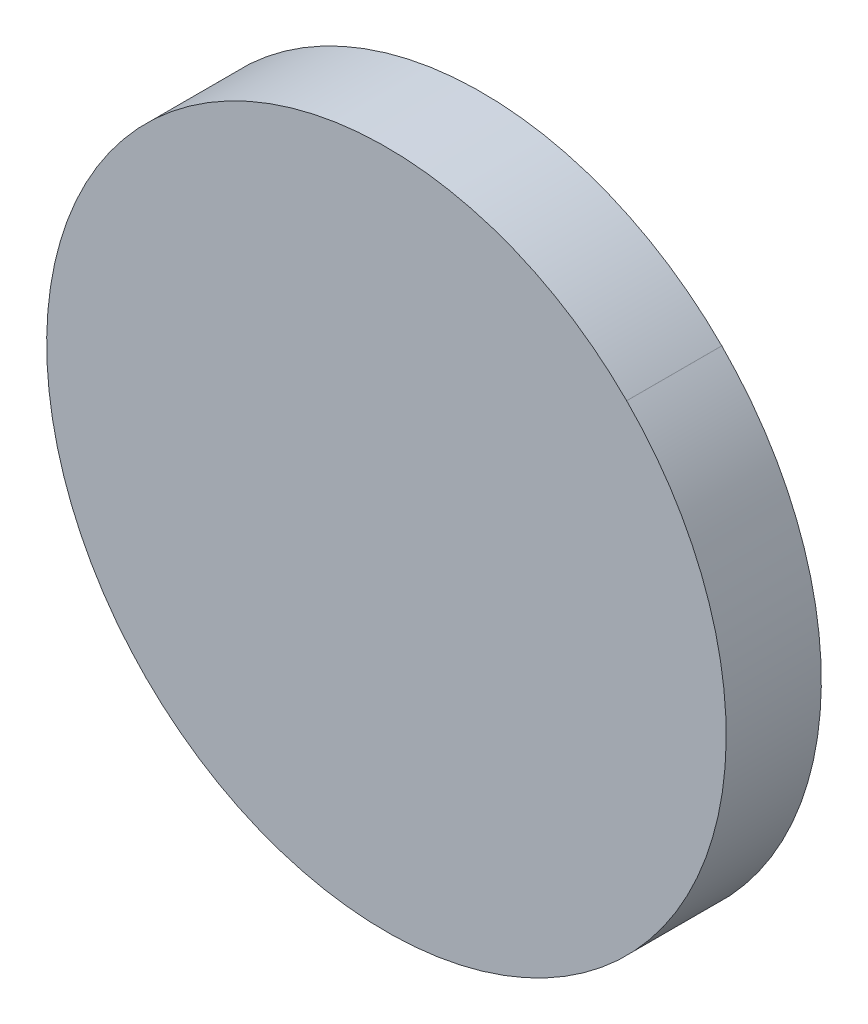
ISO-10303-21;
HEADER;
FILE_DESCRIPTION(('STEP AP214'),'2;1');
FILE_NAME('part.step','',(''),(''),'','','');
FILE_SCHEMA(('AUTOMOTIVE_DESIGN { 1 0 10303 214 1 1 1 1 }'));
ENDSEC;
DATA;
#1=APPLICATION_CONTEXT('core data for automotive mechanical design processes');
#2=APPLICATION_PROTOCOL_DEFINITION('international standard','automotive_design',2000,#1);
#3=PRODUCT_CONTEXT('',#1,'mechanical');
#4=PRODUCT('Part','Part','',(#3));
#5=PRODUCT_RELATED_PRODUCT_CATEGORY('part','',(#4));
#6=PRODUCT_DEFINITION_FORMATION('','',#4);
#7=PRODUCT_DEFINITION_CONTEXT('part definition',#1,'design');
#8=PRODUCT_DEFINITION('design','',#6,#7);
#9=PRODUCT_DEFINITION_SHAPE('','',#8);
#10=(LENGTH_UNIT() NAMED_UNIT(*) SI_UNIT(.MILLI.,.METRE.));
#11=(NAMED_UNIT(*) PLANE_ANGLE_UNIT() SI_UNIT($,.RADIAN.));
#12=(NAMED_UNIT(*) SI_UNIT($,.STERADIAN.) SOLID_ANGLE_UNIT());
#13=UNCERTAINTY_MEASURE_WITH_UNIT(LENGTH_MEASURE(1.E-05),#10,'distance_accuracy_value','');
#14=(GEOMETRIC_REPRESENTATION_CONTEXT(3) GLOBAL_UNCERTAINTY_ASSIGNED_CONTEXT((#13)) GLOBAL_UNIT_ASSIGNED_CONTEXT((#10,
#11,#12)) REPRESENTATION_CONTEXT('',''));
#15=CARTESIAN_POINT('',(0.,0.,0.));
#16=DIRECTION('',(0.,0.,1.));
#17=DIRECTION('',(1.,0.,0.));
#18=AXIS2_PLACEMENT_3D('',#15,#16,#17);
#19=CARTESIAN_POINT('',(82.7271523,66.5971871,0.));
#20=DIRECTION('',(0.707106781186548,0.707106781186548,0.));
#21=DIRECTION('',(0.707106781186548,-0.707106781186548,0.));
#22=AXIS2_PLACEMENT_3D('',#19,#20,#21);
#23=PLANE('',#22);
#24=DIRECTION('',(0.707106781186548,-0.707106781186548,0.));
#25=VECTOR('',#24,1.);
#26=CARTESIAN_POINT('',(82.7271523,66.5971871,0.03556));
#27=LINE('',#26,#25);
#28=CARTESIAN_POINT('',(82.7271523,66.5971871,0.03556));
#29=VERTEX_POINT('',#28);
#30=CARTESIAN_POINT('',(82.72715992,66.59717948,0.03556));
#31=VERTEX_POINT('',#30);
#32=EDGE_CURVE('E11',#29,#31,#27,.T.);
#33=ORIENTED_EDGE('',*,*,#32,.F.);
#34=DIRECTION('',(0.,0.,1.));
#35=VECTOR('',#34,1.);
#36=CARTESIAN_POINT('',(82.7271523,66.5971871,0.));
#37=LINE('',#36,#35);
#38=CARTESIAN_POINT('',(82.7271523,66.5971871,0.));
#39=VERTEX_POINT('',#38);
#40=EDGE_CURVE('E24',#39,#29,#37,.T.);
#41=ORIENTED_EDGE('',*,*,#40,.F.);
#42=DIRECTION('',(0.707106781186548,-0.707106781186548,0.));
#43=VECTOR('',#42,1.);
#44=CARTESIAN_POINT('',(82.7271523,66.5971871,0.));
#45=LINE('',#44,#43);
#46=CARTESIAN_POINT('',(82.72715992,66.59717948,0.));
#47=VERTEX_POINT('',#46);
#48=EDGE_CURVE('E75',#39,#47,#45,.T.);
#49=ORIENTED_EDGE('',*,*,#48,.T.);
#50=DIRECTION('',(0.,0.,1.));
#51=VECTOR('',#50,1.);
#52=CARTESIAN_POINT('',(82.72715992,66.59717948,0.));
#53=LINE('',#52,#51);
#54=EDGE_CURVE('E37',#47,#31,#53,.T.);
#55=ORIENTED_EDGE('',*,*,#54,.T.);
#56=EDGE_LOOP('',(#33,#41,#49,#55));
#57=FACE_BOUND('',#56,.T.);
#58=ADVANCED_FACE('F17',(#57),#23,.F.);
#59=CARTESIAN_POINT('',(82.81696162,66.68698245,0.));
#60=DIRECTION('',(0.,0.,-1.));
#61=DIRECTION('',(-0.707101781156337,-0.707111781181403,0.));
#62=AXIS2_PLACEMENT_3D('',#59,#60,#61);
#63=CYLINDRICAL_SURFACE('',#62,0.126999680092946);
#64=CARTESIAN_POINT('',(82.81696162,66.68698245,0.03556));
#65=DIRECTION('',(0.,0.,1.));
#66=DIRECTION('',(-0.707101781156337,-0.707111781181403,0.));
#67=AXIS2_PLACEMENT_3D('',#64,#65,#66);
#68=CIRCLE('',#67,0.126999680092946);
#69=CARTESIAN_POINT('',(82.90676332,66.77678542,0.03556));
#70=VERTEX_POINT('',#69);
#71=EDGE_CURVE('E83',#31,#70,#68,.T.);
#72=ORIENTED_EDGE('',*,*,#71,.F.);
#73=ORIENTED_EDGE('',*,*,#54,.F.);
#74=CARTESIAN_POINT('',(82.81696162,66.68698245,0.));
#75=DIRECTION('',(0.,0.,1.));
#76=DIRECTION('',(-0.707101781156337,-0.707111781181403,0.));
#77=AXIS2_PLACEMENT_3D('',#74,#75,#76);
#78=CIRCLE('',#77,0.126999680092946);
#79=CARTESIAN_POINT('',(82.90676332,66.77678542,0.));
#80=VERTEX_POINT('',#79);
#81=EDGE_CURVE('E81',#47,#80,#78,.T.);
#82=ORIENTED_EDGE('',*,*,#81,.T.);
#83=DIRECTION('',(0.,0.,1.));
#84=VECTOR('',#83,1.);
#85=CARTESIAN_POINT('',(82.90676332,66.77678542,0.));
#86=LINE('',#85,#84);
#87=EDGE_CURVE('E67',#80,#70,#86,.T.);
#88=ORIENTED_EDGE('',*,*,#87,.T.);
#89=EDGE_LOOP('',(#72,#73,#82,#88));
#90=FACE_BOUND('',#89,.T.);
#91=ADVANCED_FACE('F89',(#90),#63,.T.);
#92=CARTESIAN_POINT('',(82.90676332,66.77678542,0.));
#93=DIRECTION('',(-0.707106782175582,-0.707106780197513,0.));
#94=DIRECTION('',(-0.707106780197513,0.707106782175582,0.));
#95=AXIS2_PLACEMENT_3D('',#92,#93,#94);
#96=PLANE('',#95);
#97=DIRECTION('',(-0.707106780197513,0.707106782175582,0.));
#98=VECTOR('',#97,1.);
#99=CARTESIAN_POINT('',(82.90676332,66.77678542,0.03556));
#100=LINE('',#99,#98);
#101=CARTESIAN_POINT('',(82.90675824,66.7767905,0.03556));
#102=VERTEX_POINT('',#101);
#103=EDGE_CURVE('E71',#70,#102,#100,.T.);
#104=ORIENTED_EDGE('',*,*,#103,.F.);
#105=ORIENTED_EDGE('',*,*,#87,.F.);
#106=DIRECTION('',(-0.707106780197513,0.707106782175582,0.));
#107=VECTOR('',#106,1.);
#108=CARTESIAN_POINT('',(82.90676332,66.77678542,0.));
#109=LINE('',#108,#107);
#110=CARTESIAN_POINT('',(82.90675824,66.7767905,0.));
#111=VERTEX_POINT('',#110);
#112=EDGE_CURVE('E63',#80,#111,#109,.T.);
#113=ORIENTED_EDGE('',*,*,#112,.T.);
#114=DIRECTION('',(0.,0.,1.));
#115=VECTOR('',#114,1.);
#116=CARTESIAN_POINT('',(82.90675824,66.7767905,0.));
#117=LINE('',#116,#115);
#118=EDGE_CURVE('E53',#111,#102,#117,.T.);
#119=ORIENTED_EDGE('',*,*,#118,.T.);
#120=EDGE_LOOP('',(#104,#105,#113,#119));
#121=FACE_BOUND('',#120,.T.);
#122=ADVANCED_FACE('F66',(#121),#96,.F.);
#123=CARTESIAN_POINT('',(82.81695527,66.6869888,0.));
#124=DIRECTION('',(0.,0.,-1.));
#125=DIRECTION('',(0.707111781181459,0.707101781156281,0.));
#126=AXIS2_PLACEMENT_3D('',#123,#124,#125);
#127=CYLINDRICAL_SURFACE('',#126,0.126999680092956);
#128=CARTESIAN_POINT('',(82.81695527,66.6869888,0.03556));
#129=DIRECTION('',(0.,0.,1.));
#130=DIRECTION('',(0.707111781181459,0.707101781156281,0.));
#131=AXIS2_PLACEMENT_3D('',#128,#129,#130);
#132=CIRCLE('',#131,0.126999680092956);
#133=EDGE_CURVE('E59',#102,#29,#132,.T.);
#134=ORIENTED_EDGE('',*,*,#133,.F.);
#135=ORIENTED_EDGE('',*,*,#118,.F.);
#136=CARTESIAN_POINT('',(82.81695527,66.6869888,0.));
#137=DIRECTION('',(0.,0.,1.));
#138=DIRECTION('',(0.707111781181459,0.707101781156281,0.));
#139=AXIS2_PLACEMENT_3D('',#136,#137,#138);
#140=CIRCLE('',#139,0.126999680092956);
#141=EDGE_CURVE('E57',#111,#39,#140,.T.);
#142=ORIENTED_EDGE('',*,*,#141,.T.);
#143=ORIENTED_EDGE('',*,*,#40,.T.);
#144=EDGE_LOOP('',(#134,#135,#142,#143));
#145=FACE_BOUND('',#144,.T.);
#146=ADVANCED_FACE('F55',(#145),#127,.T.);
#147=CARTESIAN_POINT('',(82.7271523,66.5971871,0.));
#148=DIRECTION('',(0.,0.,-1.));
#149=DIRECTION('',(-1.,0.,0.));
#150=AXIS2_PLACEMENT_3D('',#147,#148,#149);
#151=PLANE('',#150);
#152=ORIENTED_EDGE('',*,*,#141,.F.);
#153=ORIENTED_EDGE('',*,*,#112,.F.);
#154=ORIENTED_EDGE('',*,*,#81,.F.);
#155=ORIENTED_EDGE('',*,*,#48,.F.);
#156=EDGE_LOOP('',(#152,#153,#154,#155));
#157=FACE_BOUND('',#156,.T.);
#158=ADVANCED_FACE('F74',(#157),#151,.T.);
#159=CARTESIAN_POINT('',(82.7271523,66.5971871,0.03556));
#160=DIRECTION('',(0.,0.,-1.));
#161=DIRECTION('',(-1.,0.,0.));
#162=AXIS2_PLACEMENT_3D('',#159,#160,#161);
#163=PLANE('',#162);
#164=ORIENTED_EDGE('',*,*,#32,.T.);
#165=ORIENTED_EDGE('',*,*,#71,.T.);
#166=ORIENTED_EDGE('',*,*,#103,.T.);
#167=ORIENTED_EDGE('',*,*,#133,.T.);
#168=EDGE_LOOP('',(#164,#165,#166,#167));
#169=FACE_BOUND('',#168,.T.);
#170=ADVANCED_FACE('F91',(#169),#163,.F.);
#171=CLOSED_SHELL('',(#58,#91,#122,#146,#158,#170));
#172=MANIFOLD_SOLID_BREP('B1',#171);
#173=ADVANCED_BREP_SHAPE_REPRESENTATION('',(#18,#172),#14);
#174=SHAPE_DEFINITION_REPRESENTATION(#9,#173);
ENDSEC;
END-ISO-10303-21;
